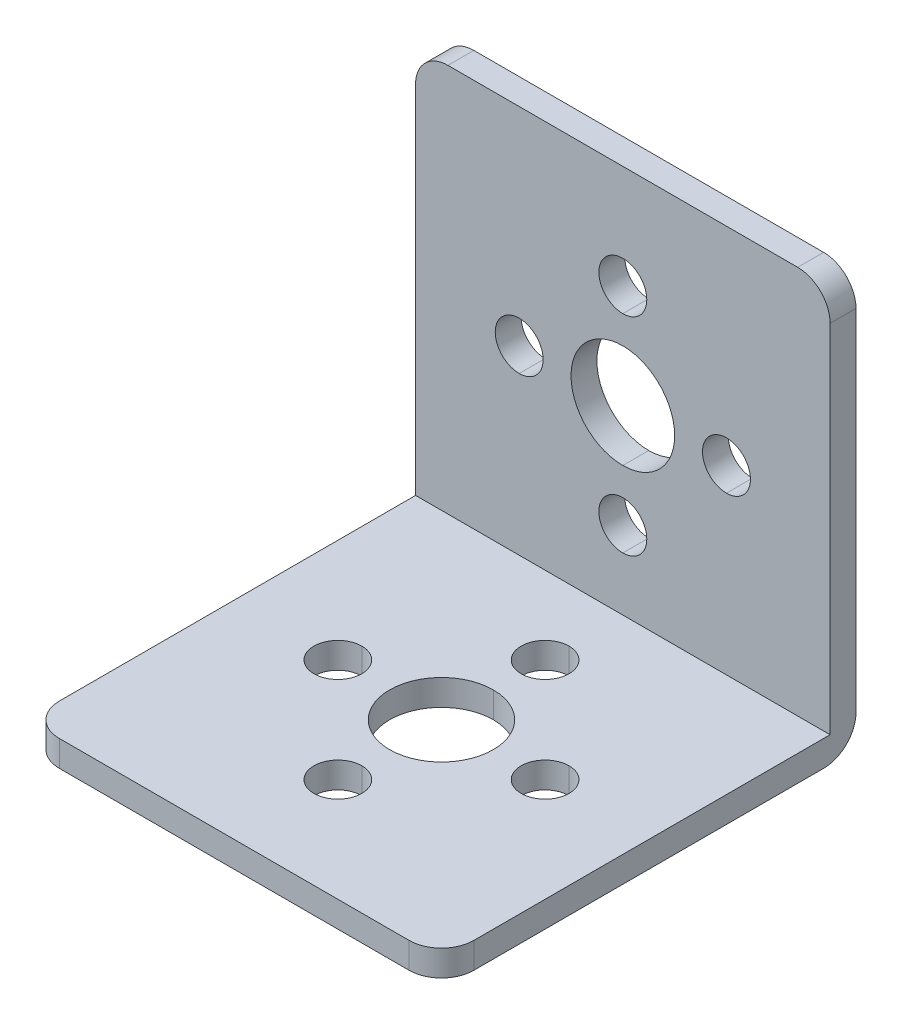
ISO-10303-21;
HEADER;
FILE_DESCRIPTION(('STEP AP214'),'2;1');
FILE_NAME('part.step','',(''),(''),'','','');
FILE_SCHEMA(('AUTOMOTIVE_DESIGN { 1 0 10303 214 1 1 1 1 }'));
ENDSEC;
DATA;
#1=APPLICATION_CONTEXT('core data for automotive mechanical design processes');
#2=APPLICATION_PROTOCOL_DEFINITION('international standard','automotive_design',2000,#1);
#3=PRODUCT_CONTEXT('',#1,'mechanical');
#4=PRODUCT('Part','Part','',(#3));
#5=PRODUCT_RELATED_PRODUCT_CATEGORY('part','',(#4));
#6=PRODUCT_DEFINITION_FORMATION('','',#4);
#7=PRODUCT_DEFINITION_CONTEXT('part definition',#1,'design');
#8=PRODUCT_DEFINITION('design','',#6,#7);
#9=PRODUCT_DEFINITION_SHAPE('','',#8);
#10=(LENGTH_UNIT() NAMED_UNIT(*) SI_UNIT(.MILLI.,.METRE.));
#11=(NAMED_UNIT(*) PLANE_ANGLE_UNIT() SI_UNIT($,.RADIAN.));
#12=(NAMED_UNIT(*) SI_UNIT($,.STERADIAN.) SOLID_ANGLE_UNIT());
#13=UNCERTAINTY_MEASURE_WITH_UNIT(LENGTH_MEASURE(1.E-05),#10,'distance_accuracy_value','');
#14=(GEOMETRIC_REPRESENTATION_CONTEXT(3) GLOBAL_UNCERTAINTY_ASSIGNED_CONTEXT((#13)) GLOBAL_UNIT_ASSIGNED_CONTEXT((#10,
#11,#12)) REPRESENTATION_CONTEXT('',''));
#15=CARTESIAN_POINT('',(0.,0.,0.));
#16=DIRECTION('',(0.,0.,1.));
#17=DIRECTION('',(1.,0.,0.));
#18=AXIS2_PLACEMENT_3D('',#15,#16,#17);
#19=CARTESIAN_POINT('',(0.,16.,-8.));
#20=DIRECTION('',(0.,-1.,0.));
#21=DIRECTION('',(0.,0.,-1.));
#22=AXIS2_PLACEMENT_3D('',#19,#20,#21);
#23=CYLINDRICAL_SURFACE('',#22,1.85);
#24=CARTESIAN_POINT('',(0.,-14.,-8.));
#25=DIRECTION('',(0.,-1.,0.));
#26=DIRECTION('',(0.,0.,-1.));
#27=AXIS2_PLACEMENT_3D('',#24,#25,#26);
#28=CIRCLE('',#27,1.85);
#29=CARTESIAN_POINT('',(0.,-14.,-6.15));
#30=VERTEX_POINT('',#29);
#31=CARTESIAN_POINT('',(0.,-14.,-9.85));
#32=VERTEX_POINT('',#31);
#33=EDGE_CURVE('E41',#30,#32,#28,.T.);
#34=ORIENTED_EDGE('',*,*,#33,.F.);
#35=DIRECTION('',(0.,-1.,0.));
#36=VECTOR('',#35,1.);
#37=CARTESIAN_POINT('',(0.,16.,-6.15));
#38=LINE('',#37,#36);
#39=CARTESIAN_POINT('',(0.,-16.,-6.15));
#40=VERTEX_POINT('',#39);
#41=EDGE_CURVE('E10',#30,#40,#38,.T.);
#42=ORIENTED_EDGE('',*,*,#41,.T.);
#43=CARTESIAN_POINT('',(0.,-16.,-8.));
#44=DIRECTION('',(0.,-1.,0.));
#45=DIRECTION('',(0.,0.,-1.));
#46=AXIS2_PLACEMENT_3D('',#43,#44,#45);
#47=CIRCLE('',#46,1.85);
#48=CARTESIAN_POINT('',(0.,-16.,-9.85));
#49=VERTEX_POINT('',#48);
#50=EDGE_CURVE('E27',#40,#49,#47,.T.);
#51=ORIENTED_EDGE('',*,*,#50,.T.);
#52=DIRECTION('',(0.,-1.,0.));
#53=VECTOR('',#52,1.);
#54=CARTESIAN_POINT('',(0.,16.,-9.85));
#55=LINE('',#54,#53);
#56=EDGE_CURVE('E429',#32,#49,#55,.T.);
#57=ORIENTED_EDGE('',*,*,#56,.F.);
#58=EDGE_LOOP('',(#34,#42,#51,#57));
#59=FACE_BOUND('',#58,.T.);
#60=ADVANCED_FACE('F16',(#59),#23,.F.);
#61=CARTESIAN_POINT('',(0.,16.,8.));
#62=DIRECTION('',(0.,-1.,0.));
#63=DIRECTION('',(0.,0.,-1.));
#64=AXIS2_PLACEMENT_3D('',#61,#62,#63);
#65=CYLINDRICAL_SURFACE('',#64,1.85);
#66=CARTESIAN_POINT('',(0.,-14.,8.));
#67=DIRECTION('',(0.,-1.,0.));
#68=DIRECTION('',(0.,0.,-1.));
#69=AXIS2_PLACEMENT_3D('',#66,#67,#68);
#70=CIRCLE('',#69,1.85);
#71=CARTESIAN_POINT('',(0.,-14.,9.85));
#72=VERTEX_POINT('',#71);
#73=CARTESIAN_POINT('',(0.,-14.,6.15));
#74=VERTEX_POINT('',#73);
#75=EDGE_CURVE('E411',#72,#74,#70,.T.);
#76=ORIENTED_EDGE('',*,*,#75,.F.);
#77=DIRECTION('',(0.,-1.,0.));
#78=VECTOR('',#77,1.);
#79=CARTESIAN_POINT('',(0.,16.,9.85));
#80=LINE('',#79,#78);
#81=CARTESIAN_POINT('',(0.,-16.,9.85));
#82=VERTEX_POINT('',#81);
#83=EDGE_CURVE('E362',#72,#82,#80,.T.);
#84=ORIENTED_EDGE('',*,*,#83,.T.);
#85=CARTESIAN_POINT('',(0.,-16.,8.));
#86=DIRECTION('',(0.,-1.,0.));
#87=DIRECTION('',(0.,0.,-1.));
#88=AXIS2_PLACEMENT_3D('',#85,#86,#87);
#89=CIRCLE('',#88,1.85);
#90=CARTESIAN_POINT('',(0.,-16.,6.15));
#91=VERTEX_POINT('',#90);
#92=EDGE_CURVE('E430',#82,#91,#89,.T.);
#93=ORIENTED_EDGE('',*,*,#92,.T.);
#94=DIRECTION('',(0.,-1.,0.));
#95=VECTOR('',#94,1.);
#96=CARTESIAN_POINT('',(0.,16.,6.15));
#97=LINE('',#96,#95);
#98=EDGE_CURVE('E367',#74,#91,#97,.T.);
#99=ORIENTED_EDGE('',*,*,#98,.F.);
#100=EDGE_LOOP('',(#76,#84,#93,#99));
#101=FACE_BOUND('',#100,.T.);
#102=ADVANCED_FACE('F694',(#101),#65,.F.);
#103=CARTESIAN_POINT('',(-8.,16.,0.));
#104=DIRECTION('',(0.,-1.,0.));
#105=DIRECTION('',(0.,0.,-1.));
#106=AXIS2_PLACEMENT_3D('',#103,#104,#105);
#107=CYLINDRICAL_SURFACE('',#106,1.85);
#108=CARTESIAN_POINT('',(-8.,-14.,0.));
#109=DIRECTION('',(0.,-1.,0.));
#110=DIRECTION('',(0.,0.,-1.));
#111=AXIS2_PLACEMENT_3D('',#108,#109,#110);
#112=CIRCLE('',#111,1.85);
#113=CARTESIAN_POINT('',(-8.,-14.,1.85));
#114=VERTEX_POINT('',#113);
#115=CARTESIAN_POINT('',(-8.,-14.,-1.85));
#116=VERTEX_POINT('',#115);
#117=EDGE_CURVE('E525',#114,#116,#112,.T.);
#118=ORIENTED_EDGE('',*,*,#117,.F.);
#119=DIRECTION('',(0.,-1.,0.));
#120=VECTOR('',#119,1.);
#121=CARTESIAN_POINT('',(-8.,16.,1.85));
#122=LINE('',#121,#120);
#123=CARTESIAN_POINT('',(-8.,-16.,1.85));
#124=VERTEX_POINT('',#123);
#125=EDGE_CURVE('E434',#114,#124,#122,.T.);
#126=ORIENTED_EDGE('',*,*,#125,.T.);
#127=CARTESIAN_POINT('',(-8.,-16.,0.));
#128=DIRECTION('',(0.,-1.,0.));
#129=DIRECTION('',(0.,0.,-1.));
#130=AXIS2_PLACEMENT_3D('',#127,#128,#129);
#131=CIRCLE('',#130,1.85);
#132=CARTESIAN_POINT('',(-8.,-16.,-1.85));
#133=VERTEX_POINT('',#132);
#134=EDGE_CURVE('E439',#124,#133,#131,.T.);
#135=ORIENTED_EDGE('',*,*,#134,.T.);
#136=DIRECTION('',(0.,-1.,0.));
#137=VECTOR('',#136,1.);
#138=CARTESIAN_POINT('',(-8.,16.,-1.85));
#139=LINE('',#138,#137);
#140=EDGE_CURVE('E350',#116,#133,#139,.T.);
#141=ORIENTED_EDGE('',*,*,#140,.F.);
#142=EDGE_LOOP('',(#118,#126,#135,#141));
#143=FACE_BOUND('',#142,.T.);
#144=ADVANCED_FACE('F700',(#143),#107,.F.);
#145=CARTESIAN_POINT('',(8.,16.,0.));
#146=DIRECTION('',(0.,-1.,0.));
#147=DIRECTION('',(0.,0.,-1.));
#148=AXIS2_PLACEMENT_3D('',#145,#146,#147);
#149=CYLINDRICAL_SURFACE('',#148,1.85);
#150=CARTESIAN_POINT('',(8.,-14.,0.));
#151=DIRECTION('',(0.,-1.,0.));
#152=DIRECTION('',(0.,0.,-1.));
#153=AXIS2_PLACEMENT_3D('',#150,#151,#152);
#154=CIRCLE('',#153,1.85);
#155=CARTESIAN_POINT('',(8.,-14.,1.85));
#156=VERTEX_POINT('',#155);
#157=CARTESIAN_POINT('',(8.,-14.,-1.85));
#158=VERTEX_POINT('',#157);
#159=EDGE_CURVE('E531',#156,#158,#154,.T.);
#160=ORIENTED_EDGE('',*,*,#159,.F.);
#161=DIRECTION('',(0.,-1.,0.));
#162=VECTOR('',#161,1.);
#163=CARTESIAN_POINT('',(8.,16.,1.85));
#164=LINE('',#163,#162);
#165=CARTESIAN_POINT('',(8.,-16.,1.85));
#166=VERTEX_POINT('',#165);
#167=EDGE_CURVE('E435',#156,#166,#164,.T.);
#168=ORIENTED_EDGE('',*,*,#167,.T.);
#169=CARTESIAN_POINT('',(8.,-16.,0.));
#170=DIRECTION('',(0.,-1.,0.));
#171=DIRECTION('',(0.,0.,-1.));
#172=AXIS2_PLACEMENT_3D('',#169,#170,#171);
#173=CIRCLE('',#172,1.85);
#174=CARTESIAN_POINT('',(8.,-16.,-1.85));
#175=VERTEX_POINT('',#174);
#176=EDGE_CURVE('E440',#166,#175,#173,.T.);
#177=ORIENTED_EDGE('',*,*,#176,.T.);
#178=DIRECTION('',(0.,-1.,0.));
#179=VECTOR('',#178,1.);
#180=CARTESIAN_POINT('',(8.,16.,-1.85));
#181=LINE('',#180,#179);
#182=EDGE_CURVE('E349',#158,#175,#181,.T.);
#183=ORIENTED_EDGE('',*,*,#182,.F.);
#184=EDGE_LOOP('',(#160,#168,#177,#183));
#185=FACE_BOUND('',#184,.T.);
#186=ADVANCED_FACE('F706',(#185),#149,.F.);
#187=CARTESIAN_POINT('',(0.,16.,0.));
#188=DIRECTION('',(0.,-1.,0.));
#189=DIRECTION('',(0.,0.,-1.));
#190=AXIS2_PLACEMENT_3D('',#187,#188,#189);
#191=CYLINDRICAL_SURFACE('',#190,4.);
#192=CARTESIAN_POINT('',(0.,-14.,0.));
#193=DIRECTION('',(0.,-1.,0.));
#194=DIRECTION('',(0.,0.,-1.));
#195=AXIS2_PLACEMENT_3D('',#192,#193,#194);
#196=CIRCLE('',#195,4.);
#197=CARTESIAN_POINT('',(0.,-14.,4.));
#198=VERTEX_POINT('',#197);
#199=CARTESIAN_POINT('',(0.,-14.,-4.));
#200=VERTEX_POINT('',#199);
#201=EDGE_CURVE('E420',#198,#200,#196,.T.);
#202=ORIENTED_EDGE('',*,*,#201,.F.);
#203=DIRECTION('',(0.,-1.,0.));
#204=VECTOR('',#203,1.);
#205=CARTESIAN_POINT('',(0.,16.,4.));
#206=LINE('',#205,#204);
#207=CARTESIAN_POINT('',(0.,-16.,4.));
#208=VERTEX_POINT('',#207);
#209=EDGE_CURVE('E409',#198,#208,#206,.T.);
#210=ORIENTED_EDGE('',*,*,#209,.T.);
#211=CARTESIAN_POINT('',(0.,-16.,0.));
#212=DIRECTION('',(0.,-1.,0.));
#213=DIRECTION('',(0.,0.,-1.));
#214=AXIS2_PLACEMENT_3D('',#211,#212,#213);
#215=CIRCLE('',#214,4.);
#216=CARTESIAN_POINT('',(0.,-16.,-4.));
#217=VERTEX_POINT('',#216);
#218=EDGE_CURVE('E405',#208,#217,#215,.T.);
#219=ORIENTED_EDGE('',*,*,#218,.T.);
#220=DIRECTION('',(0.,-1.,0.));
#221=VECTOR('',#220,1.);
#222=CARTESIAN_POINT('',(0.,16.,-4.));
#223=LINE('',#222,#221);
#224=EDGE_CURVE('E475',#200,#217,#223,.T.);
#225=ORIENTED_EDGE('',*,*,#224,.F.);
#226=EDGE_LOOP('',(#202,#210,#219,#225));
#227=FACE_BOUND('',#226,.T.);
#228=ADVANCED_FACE('F724',(#227),#191,.F.);
#229=CARTESIAN_POINT('',(0.,-8.,16.));
#230=DIRECTION('',(0.,0.,-1.));
#231=DIRECTION('',(0.,1.,0.));
#232=AXIS2_PLACEMENT_3D('',#229,#230,#231);
#233=CYLINDRICAL_SURFACE('',#232,1.85);
#234=CARTESIAN_POINT('',(0.,-8.,-14.));
#235=DIRECTION('',(0.,0.,-1.));
#236=DIRECTION('',(0.,1.,0.));
#237=AXIS2_PLACEMENT_3D('',#234,#235,#236);
#238=CIRCLE('',#237,1.85);
#239=CARTESIAN_POINT('',(0.,-9.85,-14.));
#240=VERTEX_POINT('',#239);
#241=CARTESIAN_POINT('',(0.,-6.15,-14.));
#242=VERTEX_POINT('',#241);
#243=EDGE_CURVE('E380',#240,#242,#238,.T.);
#244=ORIENTED_EDGE('',*,*,#243,.F.);
#245=DIRECTION('',(0.,0.,-1.));
#246=VECTOR('',#245,1.);
#247=CARTESIAN_POINT('',(0.,-9.85,16.));
#248=LINE('',#247,#246);
#249=CARTESIAN_POINT('',(0.,-9.85,-16.));
#250=VERTEX_POINT('',#249);
#251=EDGE_CURVE('E410',#240,#250,#248,.T.);
#252=ORIENTED_EDGE('',*,*,#251,.T.);
#253=CARTESIAN_POINT('',(0.,-8.,-16.));
#254=DIRECTION('',(0.,0.,-1.));
#255=DIRECTION('',(0.,1.,0.));
#256=AXIS2_PLACEMENT_3D('',#253,#254,#255);
#257=CIRCLE('',#256,1.85);
#258=CARTESIAN_POINT('',(0.,-6.15,-16.));
#259=VERTEX_POINT('',#258);
#260=EDGE_CURVE('E327',#250,#259,#257,.T.);
#261=ORIENTED_EDGE('',*,*,#260,.T.);
#262=DIRECTION('',(0.,0.,-1.));
#263=VECTOR('',#262,1.);
#264=CARTESIAN_POINT('',(0.,-6.15,16.));
#265=LINE('',#264,#263);
#266=EDGE_CURVE('E331',#242,#259,#265,.T.);
#267=ORIENTED_EDGE('',*,*,#266,.F.);
#268=EDGE_LOOP('',(#244,#252,#261,#267));
#269=FACE_BOUND('',#268,.T.);
#270=ADVANCED_FACE('F721',(#269),#233,.F.);
#271=CARTESIAN_POINT('',(0.,8.,16.));
#272=DIRECTION('',(0.,0.,-1.));
#273=DIRECTION('',(0.,1.,0.));
#274=AXIS2_PLACEMENT_3D('',#271,#272,#273);
#275=CYLINDRICAL_SURFACE('',#274,1.85);
#276=CARTESIAN_POINT('',(0.,8.,-14.));
#277=DIRECTION('',(0.,0.,-1.));
#278=DIRECTION('',(0.,1.,0.));
#279=AXIS2_PLACEMENT_3D('',#276,#277,#278);
#280=CIRCLE('',#279,1.85);
#281=CARTESIAN_POINT('',(0.,6.15,-14.));
#282=VERTEX_POINT('',#281);
#283=CARTESIAN_POINT('',(0.,9.85,-14.));
#284=VERTEX_POINT('',#283);
#285=EDGE_CURVE('E322',#282,#284,#280,.T.);
#286=ORIENTED_EDGE('',*,*,#285,.F.);
#287=DIRECTION('',(0.,0.,-1.));
#288=VECTOR('',#287,1.);
#289=CARTESIAN_POINT('',(0.,6.15,16.));
#290=LINE('',#289,#288);
#291=CARTESIAN_POINT('',(0.,6.15,-16.));
#292=VERTEX_POINT('',#291);
#293=EDGE_CURVE('E317',#282,#292,#290,.T.);
#294=ORIENTED_EDGE('',*,*,#293,.T.);
#295=CARTESIAN_POINT('',(0.,8.,-16.));
#296=DIRECTION('',(0.,0.,-1.));
#297=DIRECTION('',(0.,1.,0.));
#298=AXIS2_PLACEMENT_3D('',#295,#296,#297);
#299=CIRCLE('',#298,1.85);
#300=CARTESIAN_POINT('',(0.,9.85,-16.));
#301=VERTEX_POINT('',#300);
#302=EDGE_CURVE('E310',#292,#301,#299,.T.);
#303=ORIENTED_EDGE('',*,*,#302,.T.);
#304=DIRECTION('',(0.,0.,-1.));
#305=VECTOR('',#304,1.);
#306=CARTESIAN_POINT('',(0.,9.85,16.));
#307=LINE('',#306,#305);
#308=EDGE_CURVE('E61',#284,#301,#307,.T.);
#309=ORIENTED_EDGE('',*,*,#308,.F.);
#310=EDGE_LOOP('',(#286,#294,#303,#309));
#311=FACE_BOUND('',#310,.T.);
#312=ADVANCED_FACE('F321',(#311),#275,.F.);
#313=CARTESIAN_POINT('',(8.,0.,16.));
#314=DIRECTION('',(0.,0.,-1.));
#315=DIRECTION('',(0.,1.,0.));
#316=AXIS2_PLACEMENT_3D('',#313,#314,#315);
#317=CYLINDRICAL_SURFACE('',#316,1.85);
#318=CARTESIAN_POINT('',(8.,0.,-14.));
#319=DIRECTION('',(0.,0.,-1.));
#320=DIRECTION('',(0.,1.,0.));
#321=AXIS2_PLACEMENT_3D('',#318,#319,#320);
#322=CIRCLE('',#321,1.85);
#323=CARTESIAN_POINT('',(8.,-1.85,-14.));
#324=VERTEX_POINT('',#323);
#325=CARTESIAN_POINT('',(8.,1.85,-14.));
#326=VERTEX_POINT('',#325);
#327=EDGE_CURVE('E78',#324,#326,#322,.T.);
#328=ORIENTED_EDGE('',*,*,#327,.F.);
#329=DIRECTION('',(0.,0.,-1.));
#330=VECTOR('',#329,1.);
#331=CARTESIAN_POINT('',(8.,-1.85,16.));
#332=LINE('',#331,#330);
#333=CARTESIAN_POINT('',(8.,-1.85,-16.));
#334=VERTEX_POINT('',#333);
#335=EDGE_CURVE('E318',#324,#334,#332,.T.);
#336=ORIENTED_EDGE('',*,*,#335,.T.);
#337=CARTESIAN_POINT('',(8.,0.,-16.));
#338=DIRECTION('',(0.,0.,-1.));
#339=DIRECTION('',(0.,1.,0.));
#340=AXIS2_PLACEMENT_3D('',#337,#338,#339);
#341=CIRCLE('',#340,1.85);
#342=CARTESIAN_POINT('',(8.,1.85,-16.));
#343=VERTEX_POINT('',#342);
#344=EDGE_CURVE('E418',#334,#343,#341,.T.);
#345=ORIENTED_EDGE('',*,*,#344,.T.);
#346=DIRECTION('',(0.,0.,-1.));
#347=VECTOR('',#346,1.);
#348=CARTESIAN_POINT('',(8.,1.85,16.));
#349=LINE('',#348,#347);
#350=EDGE_CURVE('E392',#326,#343,#349,.T.);
#351=ORIENTED_EDGE('',*,*,#350,.F.);
#352=EDGE_LOOP('',(#328,#336,#345,#351));
#353=FACE_BOUND('',#352,.T.);
#354=ADVANCED_FACE('F708',(#353),#317,.F.);
#355=CARTESIAN_POINT('',(-8.,0.,16.));
#356=DIRECTION('',(0.,0.,-1.));
#357=DIRECTION('',(0.,1.,0.));
#358=AXIS2_PLACEMENT_3D('',#355,#356,#357);
#359=CYLINDRICAL_SURFACE('',#358,1.85);
#360=CARTESIAN_POINT('',(-8.,0.,-14.));
#361=DIRECTION('',(0.,0.,-1.));
#362=DIRECTION('',(0.,1.,0.));
#363=AXIS2_PLACEMENT_3D('',#360,#361,#362);
#364=CIRCLE('',#363,1.85);
#365=CARTESIAN_POINT('',(-8.,-1.85,-14.));
#366=VERTEX_POINT('',#365);
#367=CARTESIAN_POINT('',(-8.,1.85,-14.));
#368=VERTEX_POINT('',#367);
#369=EDGE_CURVE('E393',#366,#368,#364,.T.);
#370=ORIENTED_EDGE('',*,*,#369,.F.);
#371=DIRECTION('',(0.,0.,-1.));
#372=VECTOR('',#371,1.);
#373=CARTESIAN_POINT('',(-8.,-1.85,16.));
#374=LINE('',#373,#372);
#375=CARTESIAN_POINT('',(-8.,-1.85,-16.));
#376=VERTEX_POINT('',#375);
#377=EDGE_CURVE('E653',#366,#376,#374,.T.);
#378=ORIENTED_EDGE('',*,*,#377,.T.);
#379=CARTESIAN_POINT('',(-8.,0.,-16.));
#380=DIRECTION('',(0.,0.,-1.));
#381=DIRECTION('',(0.,1.,0.));
#382=AXIS2_PLACEMENT_3D('',#379,#380,#381);
#383=CIRCLE('',#382,1.85);
#384=CARTESIAN_POINT('',(-8.,1.85,-16.));
#385=VERTEX_POINT('',#384);
#386=EDGE_CURVE('E657',#376,#385,#383,.T.);
#387=ORIENTED_EDGE('',*,*,#386,.T.);
#388=DIRECTION('',(0.,0.,-1.));
#389=VECTOR('',#388,1.);
#390=CARTESIAN_POINT('',(-8.,1.85,16.));
#391=LINE('',#390,#389);
#392=EDGE_CURVE('E391',#368,#385,#391,.T.);
#393=ORIENTED_EDGE('',*,*,#392,.F.);
#394=EDGE_LOOP('',(#370,#378,#387,#393));
#395=FACE_BOUND('',#394,.T.);
#396=ADVANCED_FACE('F673',(#395),#359,.F.);
#397=CARTESIAN_POINT('',(0.,0.,16.));
#398=DIRECTION('',(0.,0.,-1.));
#399=DIRECTION('',(0.,1.,0.));
#400=AXIS2_PLACEMENT_3D('',#397,#398,#399);
#401=CYLINDRICAL_SURFACE('',#400,4.);
#402=CARTESIAN_POINT('',(0.,0.,-14.));
#403=DIRECTION('',(0.,0.,-1.));
#404=DIRECTION('',(0.,1.,0.));
#405=AXIS2_PLACEMENT_3D('',#402,#403,#404);
#406=CIRCLE('',#405,4.);
#407=CARTESIAN_POINT('',(0.,-4.,-14.));
#408=VERTEX_POINT('',#407);
#409=CARTESIAN_POINT('',(0.,4.,-14.));
#410=VERTEX_POINT('',#409);
#411=EDGE_CURVE('E592',#408,#410,#406,.T.);
#412=ORIENTED_EDGE('',*,*,#411,.F.);
#413=DIRECTION('',(0.,0.,-1.));
#414=VECTOR('',#413,1.);
#415=CARTESIAN_POINT('',(0.,-4.,16.));
#416=LINE('',#415,#414);
#417=CARTESIAN_POINT('',(0.,-4.,-16.));
#418=VERTEX_POINT('',#417);
#419=EDGE_CURVE('E512',#408,#418,#416,.T.);
#420=ORIENTED_EDGE('',*,*,#419,.T.);
#421=CARTESIAN_POINT('',(0.,0.,-16.));
#422=DIRECTION('',(0.,0.,-1.));
#423=DIRECTION('',(0.,1.,0.));
#424=AXIS2_PLACEMENT_3D('',#421,#422,#423);
#425=CIRCLE('',#424,4.);
#426=CARTESIAN_POINT('',(0.,4.,-16.));
#427=VERTEX_POINT('',#426);
#428=EDGE_CURVE('E509',#418,#427,#425,.T.);
#429=ORIENTED_EDGE('',*,*,#428,.T.);
#430=DIRECTION('',(0.,0.,-1.));
#431=VECTOR('',#430,1.);
#432=CARTESIAN_POINT('',(0.,4.,16.));
#433=LINE('',#432,#431);
#434=EDGE_CURVE('E425',#410,#427,#433,.T.);
#435=ORIENTED_EDGE('',*,*,#434,.F.);
#436=EDGE_LOOP('',(#412,#420,#429,#435));
#437=FACE_BOUND('',#436,.T.);
#438=ADVANCED_FACE('F717',(#437),#401,.F.);
#439=CARTESIAN_POINT('',(16.,16.,-16.));
#440=DIRECTION('',(0.,0.,1.));
#441=DIRECTION('',(1.,0.,0.));
#442=AXIS2_PLACEMENT_3D('',#439,#440,#441);
#443=PLANE('',#442);
#444=DIRECTION('',(0.,1.,0.));
#445=VECTOR('',#444,1.);
#446=CARTESIAN_POINT('',(16.,16.,-16.));
#447=LINE('',#446,#445);
#448=CARTESIAN_POINT('',(16.,-13.5,-16.));
#449=VERTEX_POINT('',#448);
#450=CARTESIAN_POINT('',(16.,13.5,-16.));
#451=VERTEX_POINT('',#450);
#452=EDGE_CURVE('E570',#449,#451,#447,.T.);
#453=ORIENTED_EDGE('',*,*,#452,.F.);
#454=DIRECTION('',(-1.,0.,0.));
#455=VECTOR('',#454,1.);
#456=CARTESIAN_POINT('',(16.,-13.5,-16.));
#457=LINE('',#456,#455);
#458=CARTESIAN_POINT('',(-16.,-13.5,-16.));
#459=VERTEX_POINT('',#458);
#460=EDGE_CURVE('E403',#449,#459,#457,.T.);
#461=ORIENTED_EDGE('',*,*,#460,.T.);
#462=DIRECTION('',(0.,1.,0.));
#463=VECTOR('',#462,1.);
#464=CARTESIAN_POINT('',(-16.,16.,-16.));
#465=LINE('',#464,#463);
#466=CARTESIAN_POINT('',(-16.,13.5,-16.));
#467=VERTEX_POINT('',#466);
#468=EDGE_CURVE('E399',#459,#467,#465,.T.);
#469=ORIENTED_EDGE('',*,*,#468,.T.);
#470=CARTESIAN_POINT('',(-13.5,13.5,-16.));
#471=DIRECTION('',(0.,0.,-1.));
#472=DIRECTION('',(0.,-1.,0.));
#473=AXIS2_PLACEMENT_3D('',#470,#471,#472);
#474=CIRCLE('',#473,2.5);
#475=CARTESIAN_POINT('',(-13.5,16.,-16.));
#476=VERTEX_POINT('',#475);
#477=EDGE_CURVE('E404',#467,#476,#474,.T.);
#478=ORIENTED_EDGE('',*,*,#477,.T.);
#479=DIRECTION('',(-1.,0.,0.));
#480=VECTOR('',#479,1.);
#481=CARTESIAN_POINT('',(16.,16.,-16.));
#482=LINE('',#481,#480);
#483=CARTESIAN_POINT('',(13.5,16.,-16.));
#484=VERTEX_POINT('',#483);
#485=EDGE_CURVE('E376',#484,#476,#482,.T.);
#486=ORIENTED_EDGE('',*,*,#485,.F.);
#487=CARTESIAN_POINT('',(13.5,13.5,-16.));
#488=DIRECTION('',(0.,0.,-1.));
#489=DIRECTION('',(0.,-1.,0.));
#490=AXIS2_PLACEMENT_3D('',#487,#488,#489);
#491=CIRCLE('',#490,2.5);
#492=EDGE_CURVE('E471',#484,#451,#491,.T.);
#493=ORIENTED_EDGE('',*,*,#492,.T.);
#494=EDGE_LOOP('',(#453,#461,#469,#478,#486,#493));
#495=FACE_BOUND('',#494,.T.);
#496=CARTESIAN_POINT('',(0.,-8.,-16.));
#497=DIRECTION('',(0.,0.,-1.));
#498=DIRECTION('',(0.,1.,0.));
#499=AXIS2_PLACEMENT_3D('',#496,#497,#498);
#500=CIRCLE('',#499,1.85);
#501=EDGE_CURVE('E340',#259,#250,#500,.T.);
#502=ORIENTED_EDGE('',*,*,#501,.F.);
#503=ORIENTED_EDGE('',*,*,#260,.F.);
#504=EDGE_LOOP('',(#502,#503));
#505=FACE_BOUND('',#504,.T.);
#506=CARTESIAN_POINT('',(0.,8.,-16.));
#507=DIRECTION('',(0.,0.,-1.));
#508=DIRECTION('',(0.,1.,0.));
#509=AXIS2_PLACEMENT_3D('',#506,#507,#508);
#510=CIRCLE('',#509,1.85);
#511=EDGE_CURVE('E315',#301,#292,#510,.T.);
#512=ORIENTED_EDGE('',*,*,#511,.F.);
#513=ORIENTED_EDGE('',*,*,#302,.F.);
#514=EDGE_LOOP('',(#512,#513));
#515=FACE_BOUND('',#514,.T.);
#516=CARTESIAN_POINT('',(8.,0.,-16.));
#517=DIRECTION('',(0.,0.,-1.));
#518=DIRECTION('',(0.,1.,0.));
#519=AXIS2_PLACEMENT_3D('',#516,#517,#518);
#520=CIRCLE('',#519,1.85);
#521=EDGE_CURVE('E338',#343,#334,#520,.T.);
#522=ORIENTED_EDGE('',*,*,#521,.F.);
#523=ORIENTED_EDGE('',*,*,#344,.F.);
#524=EDGE_LOOP('',(#522,#523));
#525=FACE_BOUND('',#524,.T.);
#526=CARTESIAN_POINT('',(-8.,0.,-16.));
#527=DIRECTION('',(0.,0.,-1.));
#528=DIRECTION('',(0.,1.,0.));
#529=AXIS2_PLACEMENT_3D('',#526,#527,#528);
#530=CIRCLE('',#529,1.85);
#531=EDGE_CURVE('E387',#385,#376,#530,.T.);
#532=ORIENTED_EDGE('',*,*,#531,.F.);
#533=ORIENTED_EDGE('',*,*,#386,.F.);
#534=EDGE_LOOP('',(#532,#533));
#535=FACE_BOUND('',#534,.T.);
#536=CARTESIAN_POINT('',(0.,0.,-16.));
#537=DIRECTION('',(0.,0.,-1.));
#538=DIRECTION('',(0.,1.,0.));
#539=AXIS2_PLACEMENT_3D('',#536,#537,#538);
#540=CIRCLE('',#539,4.);
#541=EDGE_CURVE('E477',#427,#418,#540,.T.);
#542=ORIENTED_EDGE('',*,*,#541,.F.);
#543=ORIENTED_EDGE('',*,*,#428,.F.);
#544=EDGE_LOOP('',(#542,#543));
#545=FACE_BOUND('',#544,.T.);
#546=ADVANCED_FACE('F312',(#495,#505,#515,#525,#535,#545),#443,.F.);
#547=CARTESIAN_POINT('',(16.,16.,16.));
#548=DIRECTION('',(0.,-1.,0.));
#549=DIRECTION('',(0.,0.,-1.));
#550=AXIS2_PLACEMENT_3D('',#547,#548,#549);
#551=PLANE('',#550);
#552=ORIENTED_EDGE('',*,*,#485,.T.);
#553=DIRECTION('',(0.,0.,1.));
#554=VECTOR('',#553,1.);
#555=CARTESIAN_POINT('',(-13.5,16.,16.));
#556=LINE('',#555,#554);
#557=CARTESIAN_POINT('',(-13.5,16.,-14.));
#558=VERTEX_POINT('',#557);
#559=EDGE_CURVE('E372',#476,#558,#556,.T.);
#560=ORIENTED_EDGE('',*,*,#559,.T.);
#561=DIRECTION('',(1.,0.,0.));
#562=VECTOR('',#561,1.);
#563=CARTESIAN_POINT('',(-16.,16.,-14.));
#564=LINE('',#563,#562);
#565=CARTESIAN_POINT('',(13.5,16.,-14.));
#566=VERTEX_POINT('',#565);
#567=EDGE_CURVE('E377',#558,#566,#564,.T.);
#568=ORIENTED_EDGE('',*,*,#567,.T.);
#569=DIRECTION('',(0.,0.,-1.));
#570=VECTOR('',#569,1.);
#571=CARTESIAN_POINT('',(13.5,16.,-16.));
#572=LINE('',#571,#570);
#573=EDGE_CURVE('E579',#566,#484,#572,.T.);
#574=ORIENTED_EDGE('',*,*,#573,.T.);
#575=EDGE_LOOP('',(#552,#560,#568,#574));
#576=FACE_BOUND('',#575,.T.);
#577=ADVANCED_FACE('F743',(#576),#551,.F.);
#578=CARTESIAN_POINT('',(16.,16.,16.));
#579=DIRECTION('',(0.,0.,-1.));
#580=DIRECTION('',(0.,-1.,0.));
#581=AXIS2_PLACEMENT_3D('',#578,#579,#580);
#582=PLANE('',#581);
#583=DIRECTION('',(1.,0.,0.));
#584=VECTOR('',#583,1.);
#585=CARTESIAN_POINT('',(-16.,-14.,16.));
#586=LINE('',#585,#584);
#587=CARTESIAN_POINT('',(-13.5,-14.,16.));
#588=VERTEX_POINT('',#587);
#589=CARTESIAN_POINT('',(13.5,-14.,16.));
#590=VERTEX_POINT('',#589);
#591=EDGE_CURVE('E590',#588,#590,#586,.T.);
#592=ORIENTED_EDGE('',*,*,#591,.F.);
#593=DIRECTION('',(0.,-1.,0.));
#594=VECTOR('',#593,1.);
#595=CARTESIAN_POINT('',(-13.5,16.,16.));
#596=LINE('',#595,#594);
#597=CARTESIAN_POINT('',(-13.5,-16.,16.));
#598=VERTEX_POINT('',#597);
#599=EDGE_CURVE('E507',#588,#598,#596,.T.);
#600=ORIENTED_EDGE('',*,*,#599,.T.);
#601=DIRECTION('',(-1.,0.,0.));
#602=VECTOR('',#601,1.);
#603=CARTESIAN_POINT('',(16.,-16.,16.));
#604=LINE('',#603,#602);
#605=CARTESIAN_POINT('',(13.5,-16.,16.));
#606=VERTEX_POINT('',#605);
#607=EDGE_CURVE('E560',#606,#598,#604,.T.);
#608=ORIENTED_EDGE('',*,*,#607,.F.);
#609=DIRECTION('',(0.,1.,0.));
#610=VECTOR('',#609,1.);
#611=CARTESIAN_POINT('',(13.5,-14.,16.));
#612=LINE('',#611,#610);
#613=EDGE_CURVE('E500',#606,#590,#612,.T.);
#614=ORIENTED_EDGE('',*,*,#613,.T.);
#615=EDGE_LOOP('',(#592,#600,#608,#614));
#616=FACE_BOUND('',#615,.T.);
#617=ADVANCED_FACE('F730',(#616),#582,.F.);
#618=CARTESIAN_POINT('',(16.,-16.,16.));
#619=DIRECTION('',(0.,1.,0.));
#620=DIRECTION('',(1.,0.,0.));
#621=AXIS2_PLACEMENT_3D('',#618,#619,#620);
#622=PLANE('',#621);
#623=DIRECTION('',(0.,0.,-1.));
#624=VECTOR('',#623,1.);
#625=CARTESIAN_POINT('',(-16.,-16.,16.));
#626=LINE('',#625,#624);
#627=CARTESIAN_POINT('',(-16.,-16.,13.5));
#628=VERTEX_POINT('',#627);
#629=CARTESIAN_POINT('',(-16.,-16.,-13.5));
#630=VERTEX_POINT('',#629);
#631=EDGE_CURVE('E496',#628,#630,#626,.T.);
#632=ORIENTED_EDGE('',*,*,#631,.T.);
#633=DIRECTION('',(1.,0.,0.));
#634=VECTOR('',#633,1.);
#635=CARTESIAN_POINT('',(16.,-16.,-13.5));
#636=LINE('',#635,#634);
#637=CARTESIAN_POINT('',(16.,-16.,-13.5));
#638=VERTEX_POINT('',#637);
#639=EDGE_CURVE('E501',#630,#638,#636,.T.);
#640=ORIENTED_EDGE('',*,*,#639,.T.);
#641=DIRECTION('',(0.,0.,-1.));
#642=VECTOR('',#641,1.);
#643=CARTESIAN_POINT('',(16.,-16.,16.));
#644=LINE('',#643,#642);
#645=CARTESIAN_POINT('',(16.,-16.,13.5));
#646=VERTEX_POINT('',#645);
#647=EDGE_CURVE('E561',#646,#638,#644,.T.);
#648=ORIENTED_EDGE('',*,*,#647,.F.);
#649=CARTESIAN_POINT('',(13.5,-16.,13.5));
#650=DIRECTION('',(0.,-1.,0.));
#651=DIRECTION('',(0.,0.,1.));
#652=AXIS2_PLACEMENT_3D('',#649,#650,#651);
#653=CIRCLE('',#652,2.5);
#654=EDGE_CURVE('E615',#646,#606,#653,.T.);
#655=ORIENTED_EDGE('',*,*,#654,.T.);
#656=ORIENTED_EDGE('',*,*,#607,.T.);
#657=CARTESIAN_POINT('',(-13.5,-16.,13.5));
#658=DIRECTION('',(0.,-1.,0.));
#659=DIRECTION('',(0.,0.,1.));
#660=AXIS2_PLACEMENT_3D('',#657,#658,#659);
#661=CIRCLE('',#660,2.5);
#662=EDGE_CURVE('E558',#598,#628,#661,.T.);
#663=ORIENTED_EDGE('',*,*,#662,.T.);
#664=EDGE_LOOP('',(#632,#640,#648,#655,#656,#663));
#665=FACE_BOUND('',#664,.T.);
#666=CARTESIAN_POINT('',(0.,-16.,-8.));
#667=DIRECTION('',(0.,-1.,0.));
#668=DIRECTION('',(0.,0.,-1.));
#669=AXIS2_PLACEMENT_3D('',#666,#667,#668);
#670=CIRCLE('',#669,1.85);
#671=EDGE_CURVE('E450',#49,#40,#670,.T.);
#672=ORIENTED_EDGE('',*,*,#671,.F.);
#673=ORIENTED_EDGE('',*,*,#50,.F.);
#674=EDGE_LOOP('',(#672,#673));
#675=FACE_BOUND('',#674,.T.);
#676=CARTESIAN_POINT('',(0.,-16.,8.));
#677=DIRECTION('',(0.,-1.,0.));
#678=DIRECTION('',(0.,0.,-1.));
#679=AXIS2_PLACEMENT_3D('',#676,#677,#678);
#680=CIRCLE('',#679,1.85);
#681=EDGE_CURVE('E371',#91,#82,#680,.T.);
#682=ORIENTED_EDGE('',*,*,#681,.F.);
#683=ORIENTED_EDGE('',*,*,#92,.F.);
#684=EDGE_LOOP('',(#682,#683));
#685=FACE_BOUND('',#684,.T.);
#686=CARTESIAN_POINT('',(-8.,-16.,0.));
#687=DIRECTION('',(0.,-1.,0.));
#688=DIRECTION('',(0.,0.,-1.));
#689=AXIS2_PLACEMENT_3D('',#686,#687,#688);
#690=CIRCLE('',#689,1.85);
#691=EDGE_CURVE('E370',#133,#124,#690,.T.);
#692=ORIENTED_EDGE('',*,*,#691,.F.);
#693=ORIENTED_EDGE('',*,*,#134,.F.);
#694=EDGE_LOOP('',(#692,#693));
#695=FACE_BOUND('',#694,.T.);
#696=CARTESIAN_POINT('',(8.,-16.,0.));
#697=DIRECTION('',(0.,-1.,0.));
#698=DIRECTION('',(0.,0.,-1.));
#699=AXIS2_PLACEMENT_3D('',#696,#697,#698);
#700=CIRCLE('',#699,1.85);
#701=EDGE_CURVE('E345',#175,#166,#700,.T.);
#702=ORIENTED_EDGE('',*,*,#701,.F.);
#703=ORIENTED_EDGE('',*,*,#176,.F.);
#704=EDGE_LOOP('',(#702,#703));
#705=FACE_BOUND('',#704,.T.);
#706=CARTESIAN_POINT('',(0.,-16.,0.));
#707=DIRECTION('',(0.,-1.,0.));
#708=DIRECTION('',(0.,0.,-1.));
#709=AXIS2_PLACEMENT_3D('',#706,#707,#708);
#710=CIRCLE('',#709,4.);
#711=EDGE_CURVE('E472',#217,#208,#710,.T.);
#712=ORIENTED_EDGE('',*,*,#711,.F.);
#713=ORIENTED_EDGE('',*,*,#218,.F.);
#714=EDGE_LOOP('',(#712,#713));
#715=FACE_BOUND('',#714,.T.);
#716=ADVANCED_FACE('F726',(#665,#675,#685,#695,#705,#715),#622,.F.);
#717=CARTESIAN_POINT('',(16.,-16.,-16.));
#718=DIRECTION('',(1.,0.,0.));
#719=DIRECTION('',(0.,1.,0.));
#720=AXIS2_PLACEMENT_3D('',#717,#718,#719);
#721=PLANE('',#720);
#722=ORIENTED_EDGE('',*,*,#647,.T.);
#723=CARTESIAN_POINT('',(16.,-13.5,-13.5));
#724=DIRECTION('',(1.,0.,0.));
#725=DIRECTION('',(0.,0.,-1.));
#726=AXIS2_PLACEMENT_3D('',#723,#724,#725);
#727=CIRCLE('',#726,2.5);
#728=EDGE_CURVE('E563',#638,#449,#727,.T.);
#729=ORIENTED_EDGE('',*,*,#728,.T.);
#730=ORIENTED_EDGE('',*,*,#452,.T.);
#731=DIRECTION('',(0.,0.,1.));
#732=VECTOR('',#731,1.);
#733=CARTESIAN_POINT('',(16.,13.5,-14.));
#734=LINE('',#733,#732);
#735=CARTESIAN_POINT('',(16.,13.5,-14.));
#736=VERTEX_POINT('',#735);
#737=EDGE_CURVE('E385',#451,#736,#734,.T.);
#738=ORIENTED_EDGE('',*,*,#737,.T.);
#739=DIRECTION('',(0.,1.,0.));
#740=VECTOR('',#739,1.);
#741=CARTESIAN_POINT('',(16.,16.,-14.));
#742=LINE('',#741,#740);
#743=CARTESIAN_POINT('',(16.,-14.,-14.));
#744=VERTEX_POINT('',#743);
#745=EDGE_CURVE('E357',#744,#736,#742,.T.);
#746=ORIENTED_EDGE('',*,*,#745,.F.);
#747=DIRECTION('',(0.,0.,-1.));
#748=VECTOR('',#747,1.);
#749=CARTESIAN_POINT('',(16.,-14.,16.));
#750=LINE('',#749,#748);
#751=CARTESIAN_POINT('',(16.,-14.,13.5));
#752=VERTEX_POINT('',#751);
#753=EDGE_CURVE('E591',#752,#744,#750,.T.);
#754=ORIENTED_EDGE('',*,*,#753,.F.);
#755=DIRECTION('',(0.,-1.,0.));
#756=VECTOR('',#755,1.);
#757=CARTESIAN_POINT('',(16.,-16.,13.5));
#758=LINE('',#757,#756);
#759=EDGE_CURVE('E381',#752,#646,#758,.T.);
#760=ORIENTED_EDGE('',*,*,#759,.T.);
#761=EDGE_LOOP('',(#722,#729,#730,#738,#746,#754,#760));
#762=FACE_BOUND('',#761,.T.);
#763=ADVANCED_FACE('F729',(#762),#721,.T.);
#764=CARTESIAN_POINT('',(-16.,-16.,-16.));
#765=DIRECTION('',(1.,0.,0.));
#766=DIRECTION('',(0.,1.,0.));
#767=AXIS2_PLACEMENT_3D('',#764,#765,#766);
#768=PLANE('',#767);
#769=ORIENTED_EDGE('',*,*,#468,.F.);
#770=CARTESIAN_POINT('',(-16.,-13.5,-13.5));
#771=DIRECTION('',(-1.,0.,0.));
#772=DIRECTION('',(0.,0.,-1.));
#773=AXIS2_PLACEMENT_3D('',#770,#771,#772);
#774=CIRCLE('',#773,2.5);
#775=EDGE_CURVE('E386',#459,#630,#774,.T.);
#776=ORIENTED_EDGE('',*,*,#775,.T.);
#777=ORIENTED_EDGE('',*,*,#631,.F.);
#778=DIRECTION('',(0.,1.,0.));
#779=VECTOR('',#778,1.);
#780=CARTESIAN_POINT('',(-16.,-16.,13.5));
#781=LINE('',#780,#779);
#782=CARTESIAN_POINT('',(-16.,-14.,13.5));
#783=VERTEX_POINT('',#782);
#784=EDGE_CURVE('E20',#628,#783,#781,.T.);
#785=ORIENTED_EDGE('',*,*,#784,.T.);
#786=DIRECTION('',(0.,0.,-1.));
#787=VECTOR('',#786,1.);
#788=CARTESIAN_POINT('',(-16.,-14.,16.));
#789=LINE('',#788,#787);
#790=CARTESIAN_POINT('',(-16.,-14.,-14.));
#791=VERTEX_POINT('',#790);
#792=EDGE_CURVE('E97',#783,#791,#789,.T.);
#793=ORIENTED_EDGE('',*,*,#792,.T.);
#794=DIRECTION('',(0.,1.,0.));
#795=VECTOR('',#794,1.);
#796=CARTESIAN_POINT('',(-16.,16.,-14.));
#797=LINE('',#796,#795);
#798=CARTESIAN_POINT('',(-16.,13.5,-14.));
#799=VERTEX_POINT('',#798);
#800=EDGE_CURVE('E115',#791,#799,#797,.T.);
#801=ORIENTED_EDGE('',*,*,#800,.T.);
#802=DIRECTION('',(0.,0.,-1.));
#803=VECTOR('',#802,1.);
#804=CARTESIAN_POINT('',(-16.,13.5,-16.));
#805=LINE('',#804,#803);
#806=EDGE_CURVE('E443',#799,#467,#805,.T.);
#807=ORIENTED_EDGE('',*,*,#806,.T.);
#808=EDGE_LOOP('',(#769,#776,#777,#785,#793,#801,#807));
#809=FACE_BOUND('',#808,.T.);
#810=ADVANCED_FACE('F747',(#809),#768,.F.);
#811=CARTESIAN_POINT('',(-16.,16.,-14.));
#812=DIRECTION('',(0.,0.,-1.));
#813=DIRECTION('',(-1.,0.,0.));
#814=AXIS2_PLACEMENT_3D('',#811,#812,#813);
#815=PLANE('',#814);
#816=ORIENTED_EDGE('',*,*,#567,.F.);
#817=CARTESIAN_POINT('',(-13.5,13.5,-14.));
#818=DIRECTION('',(0.,0.,1.));
#819=DIRECTION('',(0.,1.,0.));
#820=AXIS2_PLACEMENT_3D('',#817,#818,#819);
#821=CIRCLE('',#820,2.5);
#822=EDGE_CURVE('E447',#558,#799,#821,.T.);
#823=ORIENTED_EDGE('',*,*,#822,.T.);
#824=ORIENTED_EDGE('',*,*,#800,.F.);
#825=DIRECTION('',(1.,0.,0.));
#826=VECTOR('',#825,1.);
#827=CARTESIAN_POINT('',(-16.,-14.,-14.));
#828=LINE('',#827,#826);
#829=EDGE_CURVE('E444',#791,#744,#828,.T.);
#830=ORIENTED_EDGE('',*,*,#829,.T.);
#831=ORIENTED_EDGE('',*,*,#745,.T.);
#832=CARTESIAN_POINT('',(13.5,13.5,-14.));
#833=DIRECTION('',(0.,0.,1.));
#834=DIRECTION('',(0.,1.,0.));
#835=AXIS2_PLACEMENT_3D('',#832,#833,#834);
#836=CIRCLE('',#835,2.5);
#837=EDGE_CURVE('E353',#736,#566,#836,.T.);
#838=ORIENTED_EDGE('',*,*,#837,.T.);
#839=EDGE_LOOP('',(#816,#823,#824,#830,#831,#838));
#840=FACE_BOUND('',#839,.T.);
#841=CARTESIAN_POINT('',(0.,-8.,-14.));
#842=DIRECTION('',(0.,0.,-1.));
#843=DIRECTION('',(0.,1.,0.));
#844=AXIS2_PLACEMENT_3D('',#841,#842,#843);
#845=CIRCLE('',#844,1.85);
#846=EDGE_CURVE('E358',#242,#240,#845,.T.);
#847=ORIENTED_EDGE('',*,*,#846,.T.);
#848=ORIENTED_EDGE('',*,*,#243,.T.);
#849=EDGE_LOOP('',(#847,#848));
#850=FACE_BOUND('',#849,.T.);
#851=CARTESIAN_POINT('',(0.,8.,-14.));
#852=DIRECTION('',(0.,0.,-1.));
#853=DIRECTION('',(0.,1.,0.));
#854=AXIS2_PLACEMENT_3D('',#851,#852,#853);
#855=CIRCLE('',#854,1.85);
#856=EDGE_CURVE('E365',#284,#282,#855,.T.);
#857=ORIENTED_EDGE('',*,*,#856,.T.);
#858=ORIENTED_EDGE('',*,*,#285,.T.);
#859=EDGE_LOOP('',(#857,#858));
#860=FACE_BOUND('',#859,.T.);
#861=CARTESIAN_POINT('',(8.,0.,-14.));
#862=DIRECTION('',(0.,0.,-1.));
#863=DIRECTION('',(0.,1.,0.));
#864=AXIS2_PLACEMENT_3D('',#861,#862,#863);
#865=CIRCLE('',#864,1.85);
#866=EDGE_CURVE('E366',#326,#324,#865,.T.);
#867=ORIENTED_EDGE('',*,*,#866,.T.);
#868=ORIENTED_EDGE('',*,*,#327,.T.);
#869=EDGE_LOOP('',(#867,#868));
#870=FACE_BOUND('',#869,.T.);
#871=CARTESIAN_POINT('',(-8.,0.,-14.));
#872=DIRECTION('',(0.,0.,-1.));
#873=DIRECTION('',(0.,1.,0.));
#874=AXIS2_PLACEMENT_3D('',#871,#872,#873);
#875=CIRCLE('',#874,1.85);
#876=EDGE_CURVE('E397',#368,#366,#875,.T.);
#877=ORIENTED_EDGE('',*,*,#876,.T.);
#878=ORIENTED_EDGE('',*,*,#369,.T.);
#879=EDGE_LOOP('',(#877,#878));
#880=FACE_BOUND('',#879,.T.);
#881=CARTESIAN_POINT('',(0.,0.,-14.));
#882=DIRECTION('',(0.,0.,-1.));
#883=DIRECTION('',(0.,1.,0.));
#884=AXIS2_PLACEMENT_3D('',#881,#882,#883);
#885=CIRCLE('',#884,4.);
#886=EDGE_CURVE('E398',#410,#408,#885,.T.);
#887=ORIENTED_EDGE('',*,*,#886,.T.);
#888=ORIENTED_EDGE('',*,*,#411,.T.);
#889=EDGE_LOOP('',(#887,#888));
#890=FACE_BOUND('',#889,.T.);
#891=ADVANCED_FACE('F1263',(#840,#850,#860,#870,#880,#890),#815,.F.);
#892=CARTESIAN_POINT('',(-16.,-14.,16.));
#893=DIRECTION('',(0.,-1.,0.));
#894=DIRECTION('',(0.,0.,-1.));
#895=AXIS2_PLACEMENT_3D('',#892,#893,#894);
#896=PLANE('',#895);
#897=ORIENTED_EDGE('',*,*,#792,.F.);
#898=CARTESIAN_POINT('',(-13.5,-14.,13.5));
#899=DIRECTION('',(0.,1.,0.));
#900=DIRECTION('',(0.,0.,-1.));
#901=AXIS2_PLACEMENT_3D('',#898,#899,#900);
#902=CIRCLE('',#901,2.5);
#903=EDGE_CURVE('E596',#783,#588,#902,.T.);
#904=ORIENTED_EDGE('',*,*,#903,.T.);
#905=ORIENTED_EDGE('',*,*,#591,.T.);
#906=CARTESIAN_POINT('',(13.5,-14.,13.5));
#907=DIRECTION('',(0.,1.,0.));
#908=DIRECTION('',(0.,0.,-1.));
#909=AXIS2_PLACEMENT_3D('',#906,#907,#908);
#910=CIRCLE('',#909,2.5);
#911=EDGE_CURVE('E586',#590,#752,#910,.T.);
#912=ORIENTED_EDGE('',*,*,#911,.T.);
#913=ORIENTED_EDGE('',*,*,#753,.T.);
#914=ORIENTED_EDGE('',*,*,#829,.F.);
#915=EDGE_LOOP('',(#897,#904,#905,#912,#913,#914));
#916=FACE_BOUND('',#915,.T.);
#917=CARTESIAN_POINT('',(0.,-14.,-8.));
#918=DIRECTION('',(0.,-1.,0.));
#919=DIRECTION('',(0.,0.,-1.));
#920=AXIS2_PLACEMENT_3D('',#917,#918,#919);
#921=CIRCLE('',#920,1.85);
#922=EDGE_CURVE('E504',#32,#30,#921,.T.);
#923=ORIENTED_EDGE('',*,*,#922,.T.);
#924=ORIENTED_EDGE('',*,*,#33,.T.);
#925=EDGE_LOOP('',(#923,#924));
#926=FACE_BOUND('',#925,.T.);
#927=CARTESIAN_POINT('',(0.,-14.,8.));
#928=DIRECTION('',(0.,-1.,0.));
#929=DIRECTION('',(0.,0.,-1.));
#930=AXIS2_PLACEMENT_3D('',#927,#928,#929);
#931=CIRCLE('',#930,1.85);
#932=EDGE_CURVE('E415',#74,#72,#931,.T.);
#933=ORIENTED_EDGE('',*,*,#932,.T.);
#934=ORIENTED_EDGE('',*,*,#75,.T.);
#935=EDGE_LOOP('',(#933,#934));
#936=FACE_BOUND('',#935,.T.);
#937=CARTESIAN_POINT('',(-8.,-14.,0.));
#938=DIRECTION('',(0.,-1.,0.));
#939=DIRECTION('',(0.,0.,-1.));
#940=AXIS2_PLACEMENT_3D('',#937,#938,#939);
#941=CIRCLE('',#940,1.85);
#942=EDGE_CURVE('E416',#116,#114,#941,.T.);
#943=ORIENTED_EDGE('',*,*,#942,.T.);
#944=ORIENTED_EDGE('',*,*,#117,.T.);
#945=EDGE_LOOP('',(#943,#944));
#946=FACE_BOUND('',#945,.T.);
#947=CARTESIAN_POINT('',(8.,-14.,0.));
#948=DIRECTION('',(0.,-1.,0.));
#949=DIRECTION('',(0.,0.,-1.));
#950=AXIS2_PLACEMENT_3D('',#947,#948,#949);
#951=CIRCLE('',#950,1.85);
#952=EDGE_CURVE('E464',#158,#156,#951,.T.);
#953=ORIENTED_EDGE('',*,*,#952,.T.);
#954=ORIENTED_EDGE('',*,*,#159,.T.);
#955=EDGE_LOOP('',(#953,#954));
#956=FACE_BOUND('',#955,.T.);
#957=CARTESIAN_POINT('',(0.,-14.,0.));
#958=DIRECTION('',(0.,-1.,0.));
#959=DIRECTION('',(0.,0.,-1.));
#960=AXIS2_PLACEMENT_3D('',#957,#958,#959);
#961=CIRCLE('',#960,4.);
#962=EDGE_CURVE('E424',#200,#198,#961,.T.);
#963=ORIENTED_EDGE('',*,*,#962,.T.);
#964=ORIENTED_EDGE('',*,*,#201,.T.);
#965=EDGE_LOOP('',(#963,#964));
#966=FACE_BOUND('',#965,.T.);
#967=ADVANCED_FACE('F690',(#916,#926,#936,#946,#956,#966),#896,.F.);
#968=CARTESIAN_POINT('',(0.,0.,16.));
#969=DIRECTION('',(0.,0.,-1.));
#970=DIRECTION('',(0.,1.,0.));
#971=AXIS2_PLACEMENT_3D('',#968,#969,#970);
#972=CYLINDRICAL_SURFACE('',#971,4.);
#973=ORIENTED_EDGE('',*,*,#419,.F.);
#974=ORIENTED_EDGE('',*,*,#886,.F.);
#975=ORIENTED_EDGE('',*,*,#434,.T.);
#976=ORIENTED_EDGE('',*,*,#541,.T.);
#977=EDGE_LOOP('',(#973,#974,#975,#976));
#978=FACE_BOUND('',#977,.T.);
#979=ADVANCED_FACE('F680',(#978),#972,.F.);
#980=CARTESIAN_POINT('',(-8.,0.,16.));
#981=DIRECTION('',(0.,0.,-1.));
#982=DIRECTION('',(0.,1.,0.));
#983=AXIS2_PLACEMENT_3D('',#980,#981,#982);
#984=CYLINDRICAL_SURFACE('',#983,1.85);
#985=ORIENTED_EDGE('',*,*,#377,.F.);
#986=ORIENTED_EDGE('',*,*,#876,.F.);
#987=ORIENTED_EDGE('',*,*,#392,.T.);
#988=ORIENTED_EDGE('',*,*,#531,.T.);
#989=EDGE_LOOP('',(#985,#986,#987,#988));
#990=FACE_BOUND('',#989,.T.);
#991=ADVANCED_FACE('F677',(#990),#984,.F.);
#992=CARTESIAN_POINT('',(8.,0.,16.));
#993=DIRECTION('',(0.,0.,-1.));
#994=DIRECTION('',(0.,1.,0.));
#995=AXIS2_PLACEMENT_3D('',#992,#993,#994);
#996=CYLINDRICAL_SURFACE('',#995,1.85);
#997=ORIENTED_EDGE('',*,*,#335,.F.);
#998=ORIENTED_EDGE('',*,*,#866,.F.);
#999=ORIENTED_EDGE('',*,*,#350,.T.);
#1000=ORIENTED_EDGE('',*,*,#521,.T.);
#1001=EDGE_LOOP('',(#997,#998,#999,#1000));
#1002=FACE_BOUND('',#1001,.T.);
#1003=ADVANCED_FACE('F679',(#1002),#996,.F.);
#1004=CARTESIAN_POINT('',(0.,8.,16.));
#1005=DIRECTION('',(0.,0.,-1.));
#1006=DIRECTION('',(0.,1.,0.));
#1007=AXIS2_PLACEMENT_3D('',#1004,#1005,#1006);
#1008=CYLINDRICAL_SURFACE('',#1007,1.85);
#1009=ORIENTED_EDGE('',*,*,#293,.F.);
#1010=ORIENTED_EDGE('',*,*,#856,.F.);
#1011=ORIENTED_EDGE('',*,*,#308,.T.);
#1012=ORIENTED_EDGE('',*,*,#511,.T.);
#1013=EDGE_LOOP('',(#1009,#1010,#1011,#1012));
#1014=FACE_BOUND('',#1013,.T.);
#1015=ADVANCED_FACE('F329',(#1014),#1008,.F.);
#1016=CARTESIAN_POINT('',(0.,-8.,16.));
#1017=DIRECTION('',(0.,0.,-1.));
#1018=DIRECTION('',(0.,1.,0.));
#1019=AXIS2_PLACEMENT_3D('',#1016,#1017,#1018);
#1020=CYLINDRICAL_SURFACE('',#1019,1.85);
#1021=ORIENTED_EDGE('',*,*,#251,.F.);
#1022=ORIENTED_EDGE('',*,*,#846,.F.);
#1023=ORIENTED_EDGE('',*,*,#266,.T.);
#1024=ORIENTED_EDGE('',*,*,#501,.T.);
#1025=EDGE_LOOP('',(#1021,#1022,#1023,#1024));
#1026=FACE_BOUND('',#1025,.T.);
#1027=ADVANCED_FACE('F758',(#1026),#1020,.F.);
#1028=CARTESIAN_POINT('',(0.,16.,0.));
#1029=DIRECTION('',(0.,-1.,0.));
#1030=DIRECTION('',(0.,0.,-1.));
#1031=AXIS2_PLACEMENT_3D('',#1028,#1029,#1030);
#1032=CYLINDRICAL_SURFACE('',#1031,4.);
#1033=ORIENTED_EDGE('',*,*,#209,.F.);
#1034=ORIENTED_EDGE('',*,*,#962,.F.);
#1035=ORIENTED_EDGE('',*,*,#224,.T.);
#1036=ORIENTED_EDGE('',*,*,#711,.T.);
#1037=EDGE_LOOP('',(#1033,#1034,#1035,#1036));
#1038=FACE_BOUND('',#1037,.T.);
#1039=ADVANCED_FACE('F770',(#1038),#1032,.F.);
#1040=CARTESIAN_POINT('',(8.,16.,0.));
#1041=DIRECTION('',(0.,-1.,0.));
#1042=DIRECTION('',(0.,0.,-1.));
#1043=AXIS2_PLACEMENT_3D('',#1040,#1041,#1042);
#1044=CYLINDRICAL_SURFACE('',#1043,1.85);
#1045=ORIENTED_EDGE('',*,*,#167,.F.);
#1046=ORIENTED_EDGE('',*,*,#952,.F.);
#1047=ORIENTED_EDGE('',*,*,#182,.T.);
#1048=ORIENTED_EDGE('',*,*,#701,.T.);
#1049=EDGE_LOOP('',(#1045,#1046,#1047,#1048));
#1050=FACE_BOUND('',#1049,.T.);
#1051=ADVANCED_FACE('F715',(#1050),#1044,.F.);
#1052=CARTESIAN_POINT('',(-8.,16.,0.));
#1053=DIRECTION('',(0.,-1.,0.));
#1054=DIRECTION('',(0.,0.,-1.));
#1055=AXIS2_PLACEMENT_3D('',#1052,#1053,#1054);
#1056=CYLINDRICAL_SURFACE('',#1055,1.85);
#1057=ORIENTED_EDGE('',*,*,#125,.F.);
#1058=ORIENTED_EDGE('',*,*,#942,.F.);
#1059=ORIENTED_EDGE('',*,*,#140,.T.);
#1060=ORIENTED_EDGE('',*,*,#691,.T.);
#1061=EDGE_LOOP('',(#1057,#1058,#1059,#1060));
#1062=FACE_BOUND('',#1061,.T.);
#1063=ADVANCED_FACE('F711',(#1062),#1056,.F.);
#1064=CARTESIAN_POINT('',(0.,16.,8.));
#1065=DIRECTION('',(0.,-1.,0.));
#1066=DIRECTION('',(0.,0.,-1.));
#1067=AXIS2_PLACEMENT_3D('',#1064,#1065,#1066);
#1068=CYLINDRICAL_SURFACE('',#1067,1.85);
#1069=ORIENTED_EDGE('',*,*,#83,.F.);
#1070=ORIENTED_EDGE('',*,*,#932,.F.);
#1071=ORIENTED_EDGE('',*,*,#98,.T.);
#1072=ORIENTED_EDGE('',*,*,#681,.T.);
#1073=EDGE_LOOP('',(#1069,#1070,#1071,#1072));
#1074=FACE_BOUND('',#1073,.T.);
#1075=ADVANCED_FACE('F714',(#1074),#1068,.F.);
#1076=CARTESIAN_POINT('',(0.,16.,-8.));
#1077=DIRECTION('',(0.,-1.,0.));
#1078=DIRECTION('',(0.,0.,-1.));
#1079=AXIS2_PLACEMENT_3D('',#1076,#1077,#1078);
#1080=CYLINDRICAL_SURFACE('',#1079,1.85);
#1081=ORIENTED_EDGE('',*,*,#41,.F.);
#1082=ORIENTED_EDGE('',*,*,#922,.F.);
#1083=ORIENTED_EDGE('',*,*,#56,.T.);
#1084=ORIENTED_EDGE('',*,*,#671,.T.);
#1085=EDGE_LOOP('',(#1081,#1082,#1083,#1084));
#1086=FACE_BOUND('',#1085,.T.);
#1087=ADVANCED_FACE('F18',(#1086),#1080,.F.);
#1088=CARTESIAN_POINT('',(16.,-13.5,-13.5));
#1089=DIRECTION('',(-1.,0.,0.));
#1090=DIRECTION('',(0.,0.,1.));
#1091=AXIS2_PLACEMENT_3D('',#1088,#1089,#1090);
#1092=CYLINDRICAL_SURFACE('',#1091,2.5);
#1093=ORIENTED_EDGE('',*,*,#728,.F.);
#1094=ORIENTED_EDGE('',*,*,#639,.F.);
#1095=ORIENTED_EDGE('',*,*,#775,.F.);
#1096=ORIENTED_EDGE('',*,*,#460,.F.);
#1097=EDGE_LOOP('',(#1093,#1094,#1095,#1096));
#1098=FACE_BOUND('',#1097,.T.);
#1099=ADVANCED_FACE('F763',(#1098),#1092,.T.);
#1100=CARTESIAN_POINT('',(-13.5,16.,13.5));
#1101=DIRECTION('',(0.,-1.,0.));
#1102=DIRECTION('',(0.,0.,-1.));
#1103=AXIS2_PLACEMENT_3D('',#1100,#1101,#1102);
#1104=CYLINDRICAL_SURFACE('',#1103,2.5);
#1105=ORIENTED_EDGE('',*,*,#903,.F.);
#1106=ORIENTED_EDGE('',*,*,#784,.F.);
#1107=ORIENTED_EDGE('',*,*,#662,.F.);
#1108=ORIENTED_EDGE('',*,*,#599,.F.);
#1109=EDGE_LOOP('',(#1105,#1106,#1107,#1108));
#1110=FACE_BOUND('',#1109,.T.);
#1111=ADVANCED_FACE('F761',(#1110),#1104,.T.);
#1112=CARTESIAN_POINT('',(13.5,-16.,13.5));
#1113=DIRECTION('',(0.,1.,0.));
#1114=DIRECTION('',(0.,0.,1.));
#1115=AXIS2_PLACEMENT_3D('',#1112,#1113,#1114);
#1116=CYLINDRICAL_SURFACE('',#1115,2.5);
#1117=ORIENTED_EDGE('',*,*,#911,.F.);
#1118=ORIENTED_EDGE('',*,*,#613,.F.);
#1119=ORIENTED_EDGE('',*,*,#654,.F.);
#1120=ORIENTED_EDGE('',*,*,#759,.F.);
#1121=EDGE_LOOP('',(#1117,#1118,#1119,#1120));
#1122=FACE_BOUND('',#1121,.T.);
#1123=ADVANCED_FACE('F739',(#1122),#1116,.T.);
#1124=CARTESIAN_POINT('',(-13.5,13.5,16.));
#1125=DIRECTION('',(0.,0.,1.));
#1126=DIRECTION('',(1.,0.,0.));
#1127=AXIS2_PLACEMENT_3D('',#1124,#1125,#1126);
#1128=CYLINDRICAL_SURFACE('',#1127,2.5);
#1129=ORIENTED_EDGE('',*,*,#477,.F.);
#1130=ORIENTED_EDGE('',*,*,#806,.F.);
#1131=ORIENTED_EDGE('',*,*,#822,.F.);
#1132=ORIENTED_EDGE('',*,*,#559,.F.);
#1133=EDGE_LOOP('',(#1129,#1130,#1131,#1132));
#1134=FACE_BOUND('',#1133,.T.);
#1135=ADVANCED_FACE('F735',(#1134),#1128,.T.);
#1136=CARTESIAN_POINT('',(13.5,13.5,-16.));
#1137=DIRECTION('',(0.,0.,-1.));
#1138=DIRECTION('',(-1.,0.,0.));
#1139=AXIS2_PLACEMENT_3D('',#1136,#1137,#1138);
#1140=CYLINDRICAL_SURFACE('',#1139,2.5);
#1141=ORIENTED_EDGE('',*,*,#492,.F.);
#1142=ORIENTED_EDGE('',*,*,#573,.F.);
#1143=ORIENTED_EDGE('',*,*,#837,.F.);
#1144=ORIENTED_EDGE('',*,*,#737,.F.);
#1145=EDGE_LOOP('',(#1141,#1142,#1143,#1144));
#1146=FACE_BOUND('',#1145,.T.);
#1147=ADVANCED_FACE('F738',(#1146),#1140,.T.);
#1148=CLOSED_SHELL('',(#60,#102,#144,#186,#228,#270,#312,#354,#396,#438,#546,#577,#617,#716,
#763,#810,#891,#967,#979,#991,#1003,#1015,#1027,#1039,#1051,#1063,#1075,#1087,#1099,#1111,#1123,
#1135,#1147));
#1149=MANIFOLD_SOLID_BREP('B1',#1148);
#1150=ADVANCED_BREP_SHAPE_REPRESENTATION('',(#18,#1149),#14);
#1151=SHAPE_DEFINITION_REPRESENTATION(#9,#1150);
ENDSEC;
END-ISO-10303-21;
